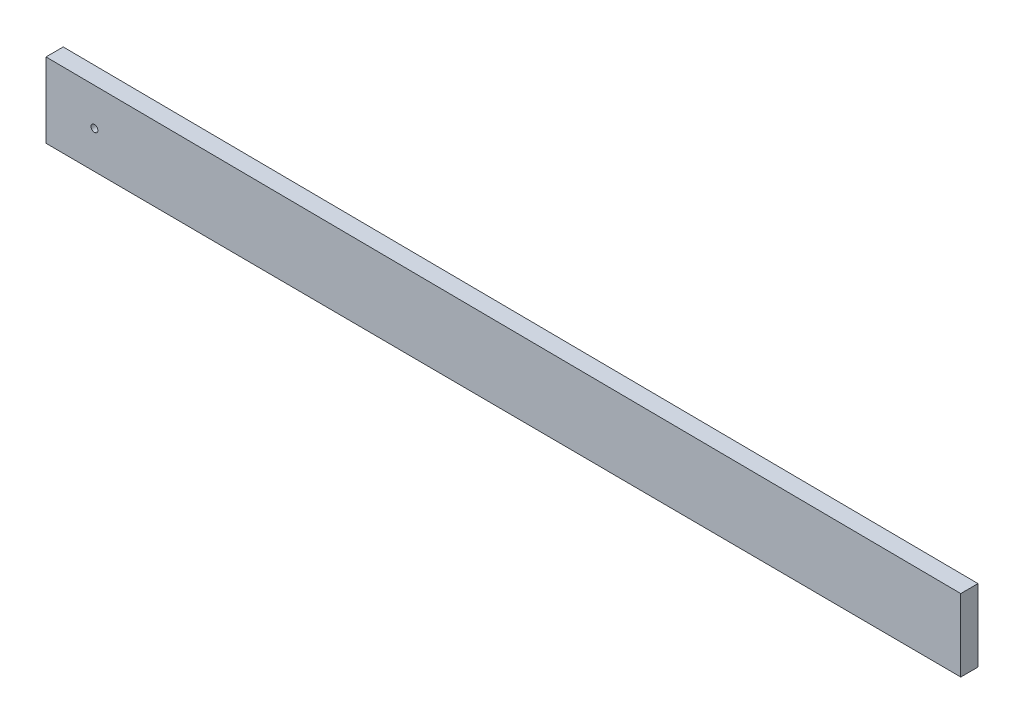
ISO-10303-21;
HEADER;
FILE_DESCRIPTION(('STEP AP214'),'2;1');
FILE_NAME('part.step','',(''),(''),'','','');
FILE_SCHEMA(('AUTOMOTIVE_DESIGN { 1 0 10303 214 1 1 1 1 }'));
ENDSEC;
DATA;
#1=APPLICATION_CONTEXT('core data for automotive mechanical design processes');
#2=APPLICATION_PROTOCOL_DEFINITION('international standard','automotive_design',2000,#1);
#3=PRODUCT_CONTEXT('',#1,'mechanical');
#4=PRODUCT('Part','Part','',(#3));
#5=PRODUCT_RELATED_PRODUCT_CATEGORY('part','',(#4));
#6=PRODUCT_DEFINITION_FORMATION('','',#4);
#7=PRODUCT_DEFINITION_CONTEXT('part definition',#1,'design');
#8=PRODUCT_DEFINITION('design','',#6,#7);
#9=PRODUCT_DEFINITION_SHAPE('','',#8);
#10=(LENGTH_UNIT() NAMED_UNIT(*) SI_UNIT(.MILLI.,.METRE.));
#11=(NAMED_UNIT(*) PLANE_ANGLE_UNIT() SI_UNIT($,.RADIAN.));
#12=(NAMED_UNIT(*) SI_UNIT($,.STERADIAN.) SOLID_ANGLE_UNIT());
#13=UNCERTAINTY_MEASURE_WITH_UNIT(LENGTH_MEASURE(1.E-05),#10,'distance_accuracy_value','');
#14=(GEOMETRIC_REPRESENTATION_CONTEXT(3) GLOBAL_UNCERTAINTY_ASSIGNED_CONTEXT((#13)) GLOBAL_UNIT_ASSIGNED_CONTEXT((#10,
#11,#12)) REPRESENTATION_CONTEXT('',''));
#15=CARTESIAN_POINT('',(0.,0.,0.));
#16=DIRECTION('',(0.,0.,1.));
#17=DIRECTION('',(1.,0.,0.));
#18=AXIS2_PLACEMENT_3D('',#15,#16,#17);
#19=CARTESIAN_POINT('',(1.14560678537427,141.958682131029,-3.175));
#20=DIRECTION('',(-0.00806973878752145,-0.999967439127845,0.));
#21=DIRECTION('',(0.999967439127845,-0.00806973878752145,0.));
#22=AXIS2_PLACEMENT_3D('',#19,#20,#21);
#23=PLANE('',#22);
#24=DIRECTION('',(0.999967439127845,-0.00806973878752145,0.));
#25=VECTOR('',#24,1.);
#26=CARTESIAN_POINT('',(1.14560678537427,141.958682131029,0.));
#27=LINE('',#26,#25);
#28=CARTESIAN_POINT('',(1.5875,141.9551160521,0.));
#29=VERTEX_POINT('',#28);
#30=CARTESIAN_POINT('',(169.8625,140.597136540633,0.));
#31=VERTEX_POINT('',#30);
#32=EDGE_CURVE('E103',#29,#31,#27,.T.);
#33=ORIENTED_EDGE('',*,*,#32,.T.);
#34=DIRECTION('',(0.,0.,1.));
#35=VECTOR('',#34,1.);
#36=CARTESIAN_POINT('',(169.8625,140.597136540633,-3.175));
#37=LINE('',#36,#35);
#38=CARTESIAN_POINT('',(169.8625,140.597136540633,-3.175));
#39=VERTEX_POINT('',#38);
#40=EDGE_CURVE('E11',#39,#31,#37,.T.);
#41=ORIENTED_EDGE('',*,*,#40,.F.);
#42=DIRECTION('',(0.999967439127845,-0.00806973878752145,0.));
#43=VECTOR('',#42,1.);
#44=CARTESIAN_POINT('',(1.14560678537427,141.958682131029,-3.175));
#45=LINE('',#44,#43);
#46=CARTESIAN_POINT('',(1.5875,141.9551160521,-3.175));
#47=VERTEX_POINT('',#46);
#48=EDGE_CURVE('E54',#47,#39,#45,.T.);
#49=ORIENTED_EDGE('',*,*,#48,.F.);
#50=DIRECTION('',(0.,0.,1.));
#51=VECTOR('',#50,1.);
#52=CARTESIAN_POINT('',(1.5875,141.9551160521,-3.175));
#53=LINE('',#52,#51);
#54=EDGE_CURVE('E39',#47,#29,#53,.T.);
#55=ORIENTED_EDGE('',*,*,#54,.T.);
#56=EDGE_LOOP('',(#33,#41,#49,#55));
#57=FACE_BOUND('',#56,.T.);
#58=ADVANCED_FACE('F35',(#57),#23,.F.);
#59=CARTESIAN_POINT('',(169.8625,0.,-3.175));
#60=DIRECTION('',(1.,0.,0.));
#61=DIRECTION('',(0.,0.,-1.));
#62=AXIS2_PLACEMENT_3D('',#59,#60,#61);
#63=PLANE('',#62);
#64=DIRECTION('',(0.,1.,0.));
#65=VECTOR('',#64,1.);
#66=CARTESIAN_POINT('',(169.8625,0.,0.));
#67=LINE('',#66,#65);
#68=CARTESIAN_POINT('',(169.8625,127.291804233008,0.));
#69=VERTEX_POINT('',#68);
#70=EDGE_CURVE('E108',#69,#31,#67,.T.);
#71=ORIENTED_EDGE('',*,*,#70,.F.);
#72=DIRECTION('',(0.,0.,1.));
#73=VECTOR('',#72,1.);
#74=CARTESIAN_POINT('',(169.8625,127.291804233008,-3.175));
#75=LINE('',#74,#73);
#76=CARTESIAN_POINT('',(169.8625,127.291804233008,-3.175));
#77=VERTEX_POINT('',#76);
#78=EDGE_CURVE('E45',#77,#69,#75,.T.);
#79=ORIENTED_EDGE('',*,*,#78,.F.);
#80=DIRECTION('',(0.,1.,0.));
#81=VECTOR('',#80,1.);
#82=CARTESIAN_POINT('',(169.8625,0.,-3.175));
#83=LINE('',#82,#81);
#84=EDGE_CURVE('E84',#77,#39,#83,.T.);
#85=ORIENTED_EDGE('',*,*,#84,.T.);
#86=ORIENTED_EDGE('',*,*,#40,.T.);
#87=EDGE_LOOP('',(#71,#79,#85,#86));
#88=FACE_BOUND('',#87,.T.);
#89=ADVANCED_FACE('F125',(#88),#63,.T.);
#90=CARTESIAN_POINT('',(0.686539390878483,128.197794553298,-3.175));
#91=DIRECTION('',(0.00535523679419878,0.99998566061663,0.));
#92=DIRECTION('',(-0.99998566061663,0.00535523679419878,0.));
#93=AXIS2_PLACEMENT_3D('',#90,#91,#92);
#94=PLANE('',#93);
#95=DIRECTION('',(-0.99998566061663,0.00535523679419878,0.));
#96=VECTOR('',#95,1.);
#97=CARTESIAN_POINT('',(0.686539390878483,128.197794553298,0.));
#98=LINE('',#97,#96);
#99=CARTESIAN_POINT('',(1.5875,128.192969626708,0.));
#100=VERTEX_POINT('',#99);
#101=EDGE_CURVE('E89',#69,#100,#98,.T.);
#102=ORIENTED_EDGE('',*,*,#101,.T.);
#103=DIRECTION('',(0.,0.,1.));
#104=VECTOR('',#103,1.);
#105=CARTESIAN_POINT('',(1.5875,128.192969626708,-3.175));
#106=LINE('',#105,#104);
#107=CARTESIAN_POINT('',(1.5875,128.192969626708,-3.175));
#108=VERTEX_POINT('',#107);
#109=EDGE_CURVE('E87',#108,#100,#106,.T.);
#110=ORIENTED_EDGE('',*,*,#109,.F.);
#111=DIRECTION('',(-0.99998566061663,0.00535523679419878,0.));
#112=VECTOR('',#111,1.);
#113=CARTESIAN_POINT('',(0.686539390878483,128.197794553298,-3.175));
#114=LINE('',#113,#112);
#115=EDGE_CURVE('E81',#77,#108,#114,.T.);
#116=ORIENTED_EDGE('',*,*,#115,.F.);
#117=ORIENTED_EDGE('',*,*,#78,.T.);
#118=EDGE_LOOP('',(#102,#110,#116,#117));
#119=FACE_BOUND('',#118,.T.);
#120=ADVANCED_FACE('F88',(#119),#94,.F.);
#121=CARTESIAN_POINT('',(10.4954413479142,135.018292569571,-3.175));
#122=DIRECTION('',(0.,0.,1.));
#123=DIRECTION('',(1.,0.,0.));
#124=AXIS2_PLACEMENT_3D('',#121,#122,#123);
#125=CYLINDRICAL_SURFACE('',#124,0.634999999999997);
#126=CARTESIAN_POINT('',(10.4954413479142,135.018292569571,-3.175));
#127=DIRECTION('',(0.,0.,1.));
#128=DIRECTION('',(1.,0.,0.));
#129=AXIS2_PLACEMENT_3D('',#126,#127,#128);
#130=CIRCLE('',#129,0.634999999999997);
#131=CARTESIAN_POINT('',(11.1304413479142,135.018292569571,-3.175));
#132=VERTEX_POINT('',#131);
#133=EDGE_CURVE('E95',#132,#132,#130,.T.);
#134=ORIENTED_EDGE('',*,*,#133,.F.);
#135=EDGE_LOOP('',(#134));
#136=FACE_BOUND('',#135,.T.);
#137=CARTESIAN_POINT('',(10.4954413479142,135.018292569571,0.));
#138=DIRECTION('',(0.,0.,1.));
#139=DIRECTION('',(1.,0.,0.));
#140=AXIS2_PLACEMENT_3D('',#137,#138,#139);
#141=CIRCLE('',#140,0.634999999999997);
#142=CARTESIAN_POINT('',(11.1304413479142,135.018292569571,0.));
#143=VERTEX_POINT('',#142);
#144=EDGE_CURVE('E100',#143,#143,#141,.T.);
#145=ORIENTED_EDGE('',*,*,#144,.T.);
#146=EDGE_LOOP('',(#145));
#147=FACE_BOUND('',#146,.T.);
#148=ADVANCED_FACE('F37',(#136,#147),#125,.F.);
#149=CARTESIAN_POINT('',(1.5875,0.,-3.175));
#150=DIRECTION('',(1.,0.,0.));
#151=DIRECTION('',(0.,0.,-1.));
#152=AXIS2_PLACEMENT_3D('',#149,#150,#151);
#153=PLANE('',#152);
#154=DIRECTION('',(0.,1.,0.));
#155=VECTOR('',#154,1.);
#156=CARTESIAN_POINT('',(1.5875,0.,0.));
#157=LINE('',#156,#155);
#158=EDGE_CURVE('E105',#100,#29,#157,.T.);
#159=ORIENTED_EDGE('',*,*,#158,.T.);
#160=ORIENTED_EDGE('',*,*,#54,.F.);
#161=DIRECTION('',(0.,1.,0.));
#162=VECTOR('',#161,1.);
#163=CARTESIAN_POINT('',(1.5875,0.,-3.175));
#164=LINE('',#163,#162);
#165=EDGE_CURVE('E79',#108,#47,#164,.T.);
#166=ORIENTED_EDGE('',*,*,#165,.F.);
#167=ORIENTED_EDGE('',*,*,#109,.T.);
#168=EDGE_LOOP('',(#159,#160,#166,#167));
#169=FACE_BOUND('',#168,.T.);
#170=ADVANCED_FACE('F92',(#169),#153,.F.);
#171=CARTESIAN_POINT('',(0.,0.,-3.175));
#172=DIRECTION('',(0.,0.,1.));
#173=DIRECTION('',(1.,0.,0.));
#174=AXIS2_PLACEMENT_3D('',#171,#172,#173);
#175=PLANE('',#174);
#176=ORIENTED_EDGE('',*,*,#133,.T.);
#177=EDGE_LOOP('',(#176));
#178=FACE_BOUND('',#177,.T.);
#179=ORIENTED_EDGE('',*,*,#48,.T.);
#180=ORIENTED_EDGE('',*,*,#84,.F.);
#181=ORIENTED_EDGE('',*,*,#115,.T.);
#182=ORIENTED_EDGE('',*,*,#165,.T.);
#183=EDGE_LOOP('',(#179,#180,#181,#182));
#184=FACE_BOUND('',#183,.T.);
#185=ADVANCED_FACE('F83',(#178,#184),#175,.F.);
#186=CARTESIAN_POINT('',(0.,0.,0.));
#187=DIRECTION('',(0.,0.,1.));
#188=DIRECTION('',(1.,0.,0.));
#189=AXIS2_PLACEMENT_3D('',#186,#187,#188);
#190=PLANE('',#189);
#191=ORIENTED_EDGE('',*,*,#144,.F.);
#192=EDGE_LOOP('',(#191));
#193=FACE_BOUND('',#192,.T.);
#194=ORIENTED_EDGE('',*,*,#32,.F.);
#195=ORIENTED_EDGE('',*,*,#158,.F.);
#196=ORIENTED_EDGE('',*,*,#101,.F.);
#197=ORIENTED_EDGE('',*,*,#70,.T.);
#198=EDGE_LOOP('',(#194,#195,#196,#197));
#199=FACE_BOUND('',#198,.T.);
#200=ADVANCED_FACE('F121',(#193,#199),#190,.T.);
#201=CLOSED_SHELL('',(#58,#89,#120,#148,#170,#185,#200));
#202=MANIFOLD_SOLID_BREP('B2',#201);
#203=ADVANCED_BREP_SHAPE_REPRESENTATION('',(#18,#202),#14);
#204=SHAPE_DEFINITION_REPRESENTATION(#9,#203);
ENDSEC;
END-ISO-10303-21;
